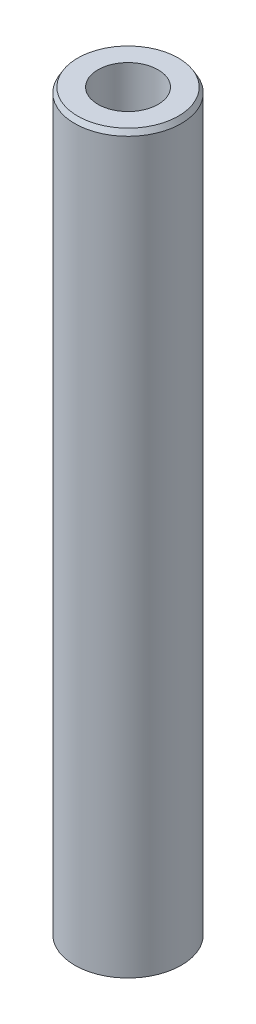
ISO-10303-21;
HEADER;
FILE_DESCRIPTION(('STEP AP214'),'2;1');
FILE_NAME('part.step','',(''),(''),'','','');
FILE_SCHEMA(('AUTOMOTIVE_DESIGN { 1 0 10303 214 1 1 1 1 }'));
ENDSEC;
DATA;
#1=APPLICATION_CONTEXT('core data for automotive mechanical design processes');
#2=APPLICATION_PROTOCOL_DEFINITION('international standard','automotive_design',2000,#1);
#3=PRODUCT_CONTEXT('',#1,'mechanical');
#4=PRODUCT('Part','Part','',(#3));
#5=PRODUCT_RELATED_PRODUCT_CATEGORY('part','',(#4));
#6=PRODUCT_DEFINITION_FORMATION('','',#4);
#7=PRODUCT_DEFINITION_CONTEXT('part definition',#1,'design');
#8=PRODUCT_DEFINITION('design','',#6,#7);
#9=PRODUCT_DEFINITION_SHAPE('','',#8);
#10=(LENGTH_UNIT() NAMED_UNIT(*) SI_UNIT(.MILLI.,.METRE.));
#11=(NAMED_UNIT(*) PLANE_ANGLE_UNIT() SI_UNIT($,.RADIAN.));
#12=(NAMED_UNIT(*) SI_UNIT($,.STERADIAN.) SOLID_ANGLE_UNIT());
#13=UNCERTAINTY_MEASURE_WITH_UNIT(LENGTH_MEASURE(1.E-05),#10,'distance_accuracy_value','');
#14=(GEOMETRIC_REPRESENTATION_CONTEXT(3) GLOBAL_UNCERTAINTY_ASSIGNED_CONTEXT((#13)) GLOBAL_UNIT_ASSIGNED_CONTEXT((#10,
#11,#12)) REPRESENTATION_CONTEXT('',''));
#15=CARTESIAN_POINT('',(0.,0.,0.));
#16=DIRECTION('',(0.,0.,1.));
#17=DIRECTION('',(1.,0.,0.));
#18=AXIS2_PLACEMENT_3D('',#15,#16,#17);
#19=CARTESIAN_POINT('',(0.,346.040194897488,0.));
#20=DIRECTION('',(0.,-1.,0.));
#21=DIRECTION('',(0.,0.,-1.));
#22=AXIS2_PLACEMENT_3D('',#19,#20,#21);
#23=CYLINDRICAL_SURFACE('',#22,25.);
#24=CARTESIAN_POINT('',(0.,343.684730383366,0.));
#25=DIRECTION('',(0.,1.,0.));
#26=DIRECTION('',(0.,0.,1.));
#27=AXIS2_PLACEMENT_3D('',#24,#25,#26);
#28=CIRCLE('',#27,25.);
#29=CARTESIAN_POINT('',(0.,343.684730383366,-25.));
#30=VERTEX_POINT('',#29);
#31=EDGE_CURVE('E50',#30,#30,#28,.F.);
#32=CARTESIAN_POINT('',(0.,1.35992807129515,0.));
#33=DIRECTION('',(0.,1.,0.));
#34=DIRECTION('',(0.,0.,1.));
#35=AXIS2_PLACEMENT_3D('',#32,#33,#34);
#36=CIRCLE('',#35,25.);
#37=CARTESIAN_POINT('',(0.,1.35992807129515,-25.));
#38=VERTEX_POINT('',#37);
#39=EDGE_CURVE('E51',#38,#38,#36,.T.);
#40=CARTESIAN_POINT('',(0.,343.684730383366,-25.));
#41=CARTESIAN_POINT('',(0.,340.118847025949,-25.));
#42=CARTESIAN_POINT('',(0.,336.552963668531,-25.));
#43=CARTESIAN_POINT('',(0.,329.421196953696,-25.));
#44=CARTESIAN_POINT('',(0.,325.855313596279,-25.));
#45=CARTESIAN_POINT('',(0.,318.723546881444,-25.));
#46=CARTESIAN_POINT('',(0.,315.157663524027,-25.));
#47=CARTESIAN_POINT('',(0.,308.025896809192,-25.));
#48=CARTESIAN_POINT('',(0.,304.460013451775,-25.));
#49=CARTESIAN_POINT('',(0.,297.32824673694,-25.));
#50=CARTESIAN_POINT('',(0.,293.762363379522,-25.));
#51=CARTESIAN_POINT('',(0.,286.630596664688,-25.));
#52=CARTESIAN_POINT('',(0.,283.06471330727,-25.));
#53=CARTESIAN_POINT('',(0.,275.932946592435,-25.));
#54=CARTESIAN_POINT('',(0.,272.367063235018,-25.));
#55=CARTESIAN_POINT('',(0.,265.235296520183,-25.));
#56=CARTESIAN_POINT('',(0.,261.669413162766,-25.));
#57=CARTESIAN_POINT('',(0.,254.537646447931,-25.));
#58=CARTESIAN_POINT('',(0.,250.971763090513,-25.));
#59=CARTESIAN_POINT('',(0.,243.839996375679,-25.));
#60=CARTESIAN_POINT('',(0.,240.274113018261,-25.));
#61=CARTESIAN_POINT('',(0.,233.142346303426,-25.));
#62=CARTESIAN_POINT('',(0.,229.576462946009,-25.));
#63=CARTESIAN_POINT('',(0.,222.444696231174,-25.));
#64=CARTESIAN_POINT('',(0.,218.878812873757,-25.));
#65=CARTESIAN_POINT('',(0.,211.747046158922,-25.));
#66=CARTESIAN_POINT('',(0.,208.181162801505,-25.));
#67=CARTESIAN_POINT('',(0.,201.04939608667,-25.));
#68=CARTESIAN_POINT('',(0.,197.483512729252,-25.));
#69=CARTESIAN_POINT('',(0.,190.351746014418,-25.));
#70=CARTESIAN_POINT('',(0.,186.785862657,-25.));
#71=CARTESIAN_POINT('',(0.,179.654095942165,-25.));
#72=CARTESIAN_POINT('',(0.,176.088212584748,-25.));
#73=CARTESIAN_POINT('',(0.,168.956445869913,-25.));
#74=CARTESIAN_POINT('',(0.,165.390562512496,-25.));
#75=CARTESIAN_POINT('',(0.,158.258795797661,-25.));
#76=CARTESIAN_POINT('',(0.,154.692912440244,-25.));
#77=CARTESIAN_POINT('',(0.,147.561145725409,-25.));
#78=CARTESIAN_POINT('',(0.,143.995262367991,-25.));
#79=CARTESIAN_POINT('',(0.,136.863495653156,-25.));
#80=CARTESIAN_POINT('',(0.,133.297612295739,-25.));
#81=CARTESIAN_POINT('',(0.,126.165845580904,-25.));
#82=CARTESIAN_POINT('',(0.,122.599962223487,-25.));
#83=CARTESIAN_POINT('',(0.,115.468195508652,-25.));
#84=CARTESIAN_POINT('',(0.,111.902312151235,-25.));
#85=CARTESIAN_POINT('',(0.,104.7705454364,-25.));
#86=CARTESIAN_POINT('',(0.,101.204662078982,-25.));
#87=CARTESIAN_POINT('',(0.,94.0728953641477,-25.));
#88=CARTESIAN_POINT('',(0.,90.5070120067303,-25.));
#89=CARTESIAN_POINT('',(0.,83.3752452918955,-25.));
#90=CARTESIAN_POINT('',(0.,79.809361934478,-25.));
#91=CARTESIAN_POINT('',(0.,72.6775952196432,-25.));
#92=CARTESIAN_POINT('',(0.,69.1117118622258,-25.));
#93=CARTESIAN_POINT('',(0.,61.979945147391,-25.));
#94=CARTESIAN_POINT('',(0.,58.4140617899736,-25.));
#95=CARTESIAN_POINT('',(0.,51.2822950751388,-25.));
#96=CARTESIAN_POINT('',(0.,47.7164117177214,-25.));
#97=CARTESIAN_POINT('',(0.,40.5846450028866,-25.));
#98=CARTESIAN_POINT('',(0.,37.0187616454692,-25.));
#99=CARTESIAN_POINT('',(0.,29.8869949306344,-25.));
#100=CARTESIAN_POINT('',(0.,26.321111573217,-25.));
#101=CARTESIAN_POINT('',(0.,19.1893448583822,-25.));
#102=CARTESIAN_POINT('',(0.,15.6234615009648,-25.));
#103=CARTESIAN_POINT('',(0.,8.49169478612995,-25.));
#104=CARTESIAN_POINT('',(0.,4.92581142871255,-25.));
#105=CARTESIAN_POINT('',(0.,1.35992807129515,-25.));
#106=B_SPLINE_CURVE_WITH_KNOTS('',3,(#40,#41,#42,#43,#44,#45,#46,#47,#48,#49,#50,#51,#52,#53,
#54,#55,#56,#57,#58,#59,#60,#61,#62,#63,#64,#65,#66,#67,#68,#69,#70,#71,#72,#73,#74,#75,#76,#77,
#78,#79,#80,#81,#82,#83,#84,#85,#86,#87,#88,#89,#90,#91,#92,#93,#94,#95,#96,#97,#98,#99,#100,
#101,#102,#103,#104,#105),.UNSPECIFIED.,.F.,.F.,(4,2,2,2,2,2,2,2,2,2,2,2,2,2,2,2,2,2,2,2,2,2,2,
2,2,2,2,2,2,2,2,2,4),(0.,10.6976500722523,21.3953001445045,32.0929502167567,42.7906002890089,
53.4882503612611,64.1859004335133,74.8835505057655,85.5812005780178,96.27885065027,
106.976500722522,117.674150794774,128.371800867027,139.069450939279,149.767101011531,
160.464751083783,171.162401156035,181.860051228288,192.55770130054,203.255351372792,
213.953001445044,224.650651517297,235.348301589549,246.045951661801,256.743601734053,
267.441251806305,278.138901878558,288.83655195081,299.534202023062,310.231852095314,
320.929502167567,331.627152239819,342.324802312071),.UNSPECIFIED.);
#107=EDGE_CURVE('BSEAM39',#30,#38,#106,.T.);
#108=ORIENTED_EDGE('',*,*,#31,.T.);
#109=ORIENTED_EDGE('',*,*,#39,.T.);
#110=ORIENTED_EDGE('',*,*,#107,.T.);
#111=ORIENTED_EDGE('',*,*,#107,.F.);
#112=EDGE_LOOP('',(#108,#110,#109,#111));
#113=FACE_BOUND('',#112,.T.);
#114=ADVANCED_FACE('F39',(#113),#23,.T.);
#115=CARTESIAN_POINT('',(0.,346.040194897488,0.));
#116=DIRECTION('',(0.,1.,0.));
#117=DIRECTION('',(0.,0.,1.));
#118=AXIS2_PLACEMENT_3D('',#115,#116,#117);
#119=PLANE('',#118);
#120=CARTESIAN_POINT('',(0.,346.040194897488,0.));
#121=DIRECTION('',(0.,1.,0.));
#122=DIRECTION('',(0.,0.,1.));
#123=AXIS2_PLACEMENT_3D('',#120,#121,#122);
#124=CIRCLE('',#123,23.6400719287051);
#125=CARTESIAN_POINT('',(0.,346.040194897488,-23.6400719287051));
#126=VERTEX_POINT('',#125);
#127=EDGE_CURVE('E54',#126,#126,#124,.T.);
#128=ORIENTED_EDGE('',*,*,#127,.T.);
#129=EDGE_LOOP('',(#128));
#130=FACE_BOUND('',#129,.T.);
#131=CARTESIAN_POINT('',(0.,346.040194897488,0.));
#132=DIRECTION('',(0.,1.,0.));
#133=DIRECTION('',(0.,0.,1.));
#134=AXIS2_PLACEMENT_3D('',#131,#132,#133);
#135=CIRCLE('',#134,14.1102254185746);
#136=CARTESIAN_POINT('',(0.,346.040194897488,-14.1102254185746));
#137=VERTEX_POINT('',#136);
#138=EDGE_CURVE('E58',#137,#137,#135,.T.);
#139=ORIENTED_EDGE('',*,*,#138,.F.);
#140=EDGE_LOOP('',(#139));
#141=FACE_BOUND('',#140,.T.);
#142=ADVANCED_FACE('F69',(#130,#141),#119,.T.);
#143=CARTESIAN_POINT('',(0.,0.,0.));
#144=DIRECTION('',(0.,1.,0.));
#145=DIRECTION('',(0.,0.,1.));
#146=AXIS2_PLACEMENT_3D('',#143,#144,#145);
#147=PLANE('',#146);
#148=CARTESIAN_POINT('',(0.,0.,0.));
#149=DIRECTION('',(0.,1.,0.));
#150=DIRECTION('',(0.,0.,1.));
#151=AXIS2_PLACEMENT_3D('',#148,#149,#150);
#152=CIRCLE('',#151,22.6445354858776);
#153=CARTESIAN_POINT('',(0.,0.,22.6445354858776));
#154=VERTEX_POINT('',#153);
#155=EDGE_CURVE('E10',#154,#154,#152,.F.);
#156=ORIENTED_EDGE('',*,*,#155,.T.);
#157=EDGE_LOOP('',(#156));
#158=FACE_BOUND('',#157,.T.);
#159=CARTESIAN_POINT('',(0.,0.,0.));
#160=DIRECTION('',(0.,1.,0.));
#161=DIRECTION('',(0.,0.,1.));
#162=AXIS2_PLACEMENT_3D('',#159,#160,#161);
#163=CIRCLE('',#162,14.1102254185746);
#164=CARTESIAN_POINT('',(0.,0.,-14.1102254185746));
#165=VERTEX_POINT('',#164);
#166=EDGE_CURVE('E63',#165,#165,#163,.T.);
#167=ORIENTED_EDGE('',*,*,#166,.T.);
#168=EDGE_LOOP('',(#167));
#169=FACE_BOUND('',#168,.T.);
#170=ADVANCED_FACE('F75',(#158,#169),#147,.F.);
#171=CARTESIAN_POINT('',(0.,346.040194897488,0.));
#172=DIRECTION('',(0.,-1.,0.));
#173=DIRECTION('',(0.,0.,-1.));
#174=AXIS2_PLACEMENT_3D('',#171,#172,#173);
#175=CYLINDRICAL_SURFACE('',#174,14.1102254185746);
#176=CARTESIAN_POINT('',(0.,346.040194897488,-14.1102254185746));
#177=CARTESIAN_POINT('',(0.,342.435609533972,-14.1102254185746));
#178=CARTESIAN_POINT('',(0.,338.831024170457,-14.1102254185746));
#179=CARTESIAN_POINT('',(0.,331.621853443426,-14.1102254185746));
#180=CARTESIAN_POINT('',(0.,328.01726807991,-14.1102254185746));
#181=CARTESIAN_POINT('',(0.,320.808097352879,-14.1102254185746));
#182=CARTESIAN_POINT('',(0.,317.203511989364,-14.1102254185746));
#183=CARTESIAN_POINT('',(0.,309.994341262333,-14.1102254185746));
#184=CARTESIAN_POINT('',(0.,306.389755898817,-14.1102254185746));
#185=CARTESIAN_POINT('',(0.,299.180585171786,-14.1102254185746));
#186=CARTESIAN_POINT('',(0.,295.575999808271,-14.1102254185746));
#187=CARTESIAN_POINT('',(0.,288.36682908124,-14.1102254185746));
#188=CARTESIAN_POINT('',(0.,284.762243717724,-14.1102254185746));
#189=CARTESIAN_POINT('',(0.,277.553072990693,-14.1102254185746));
#190=CARTESIAN_POINT('',(0.,273.948487627178,-14.1102254185746));
#191=CARTESIAN_POINT('',(0.,266.739316900147,-14.1102254185746));
#192=CARTESIAN_POINT('',(0.,263.134731536631,-14.1102254185746));
#193=CARTESIAN_POINT('',(0.,255.9255608096,-14.1102254185746));
#194=CARTESIAN_POINT('',(0.,252.320975446085,-14.1102254185746));
#195=CARTESIAN_POINT('',(0.,245.111804719054,-14.1102254185746));
#196=CARTESIAN_POINT('',(0.,241.507219355538,-14.1102254185746));
#197=CARTESIAN_POINT('',(0.,234.298048628507,-14.1102254185746));
#198=CARTESIAN_POINT('',(0.,230.693463264992,-14.1102254185746));
#199=CARTESIAN_POINT('',(0.,223.484292537961,-14.1102254185746));
#200=CARTESIAN_POINT('',(0.,219.879707174445,-14.1102254185746));
#201=CARTESIAN_POINT('',(0.,212.670536447415,-14.1102254185746));
#202=CARTESIAN_POINT('',(0.,209.065951083899,-14.1102254185746));
#203=CARTESIAN_POINT('',(0.,201.856780356868,-14.1102254185746));
#204=CARTESIAN_POINT('',(0.,198.252194993353,-14.1102254185746));
#205=CARTESIAN_POINT('',(0.,191.043024266322,-14.1102254185746));
#206=CARTESIAN_POINT('',(0.,187.438438902806,-14.1102254185746));
#207=CARTESIAN_POINT('',(0.,180.229268175775,-14.1102254185746));
#208=CARTESIAN_POINT('',(0.,176.624682812259,-14.1102254185746));
#209=CARTESIAN_POINT('',(0.,169.415512085228,-14.1102254185746));
#210=CARTESIAN_POINT('',(0.,165.810926721713,-14.1102254185746));
#211=CARTESIAN_POINT('',(0.,158.601755994682,-14.1102254185746));
#212=CARTESIAN_POINT('',(0.,154.997170631167,-14.1102254185746));
#213=CARTESIAN_POINT('',(0.,147.787999904135,-14.1102254185746));
#214=CARTESIAN_POINT('',(0.,144.18341454062,-14.1102254185746));
#215=CARTESIAN_POINT('',(0.,136.974243813589,-14.1102254185746));
#216=CARTESIAN_POINT('',(0.,133.369658450073,-14.1102254185746));
#217=CARTESIAN_POINT('',(0.,126.160487723043,-14.1102254185746));
#218=CARTESIAN_POINT('',(0.,122.555902359527,-14.1102254185746));
#219=CARTESIAN_POINT('',(0.,115.346731632496,-14.1102254185746));
#220=CARTESIAN_POINT('',(0.,111.742146268981,-14.1102254185746));
#221=CARTESIAN_POINT('',(0.,104.532975541949,-14.1102254185746));
#222=CARTESIAN_POINT('',(0.,100.928390178434,-14.1102254185746));
#223=CARTESIAN_POINT('',(0.,93.719219451403,-14.1102254185746));
#224=CARTESIAN_POINT('',(0.,90.1146340878875,-14.1102254185746));
#225=CARTESIAN_POINT('',(0.,82.9054633608565,-14.1102254185746));
#226=CARTESIAN_POINT('',(0.,79.300877997341,-14.1102254185746));
#227=CARTESIAN_POINT('',(0.,72.09170727031,-14.1102254185746));
#228=CARTESIAN_POINT('',(0.,68.4871219067945,-14.1102254185746));
#229=CARTESIAN_POINT('',(0.,61.2779511797635,-14.1102254185746));
#230=CARTESIAN_POINT('',(0.,57.673365816248,-14.1102254185746));
#231=CARTESIAN_POINT('',(0.,50.464195089217,-14.1102254185746));
#232=CARTESIAN_POINT('',(0.,46.8596097257015,-14.1102254185746));
#233=CARTESIAN_POINT('',(0.,39.6504389986705,-14.1102254185746));
#234=CARTESIAN_POINT('',(0.,36.045853635155,-14.1102254185746));
#235=CARTESIAN_POINT('',(0.,28.836682908124,-14.1102254185746));
#236=CARTESIAN_POINT('',(0.,25.2320975446085,-14.1102254185746));
#237=CARTESIAN_POINT('',(0.,18.0229268175775,-14.1102254185746));
#238=CARTESIAN_POINT('',(0.,14.418341454062,-14.1102254185746));
#239=CARTESIAN_POINT('',(0.,7.20917072703102,-14.1102254185746));
#240=CARTESIAN_POINT('',(0.,3.60458536351551,-14.1102254185746));
#241=CARTESIAN_POINT('',(0.,0.,-14.1102254185746));
#242=B_SPLINE_CURVE_WITH_KNOTS('',3,(#176,#177,#178,#179,#180,#181,#182,#183,#184,#185,#186,
#187,#188,#189,#190,#191,#192,#193,#194,#195,#196,#197,#198,#199,#200,#201,#202,#203,#204,#205,
#206,#207,#208,#209,#210,#211,#212,#213,#214,#215,#216,#217,#218,#219,#220,#221,#222,#223,#224,
#225,#226,#227,#228,#229,#230,#231,#232,#233,#234,#235,#236,#237,#238,#239,#240,#241),
.UNSPECIFIED.,.F.,.F.,(4,2,2,2,2,2,2,2,2,2,2,2,2,2,2,2,2,2,2,2,2,2,2,2,2,2,2,2,2,2,2,2,4),(0.,
10.8137560905465,21.627512181093,32.4412682716395,43.255024362186,54.0687804527324,
64.882536543279,75.6962926338255,86.510048724372,97.3238048149184,108.137560905465,
118.951316996011,129.765073086558,140.578829177104,151.392585267651,162.206341358197,
173.020097448744,183.83385353929,194.647609629837,205.461365720383,216.27512181093,
227.088877901476,237.902633992023,248.716390082569,259.530146173116,270.343902263662,
281.157658354209,291.971414444755,302.785170535302,313.598926625848,324.412682716395,
335.226438806941,346.040194897488),.UNSPECIFIED.);
#243=EDGE_CURVE('BSEAM70',#137,#165,#242,.T.);
#244=ORIENTED_EDGE('',*,*,#138,.T.);
#245=ORIENTED_EDGE('',*,*,#166,.F.);
#246=ORIENTED_EDGE('',*,*,#243,.T.);
#247=ORIENTED_EDGE('',*,*,#243,.F.);
#248=EDGE_LOOP('',(#244,#246,#245,#247));
#249=FACE_BOUND('',#248,.T.);
#250=ADVANCED_FACE('F70',(#249),#175,.F.);
#251=CARTESIAN_POINT('',(0.,346.040194897488,0.));
#252=DIRECTION('',(0.,-1.,0.));
#253=DIRECTION('',(0.,0.,-1.));
#254=AXIS2_PLACEMENT_3D('',#251,#252,#253);
#255=CONICAL_SURFACE('',#254,23.6400719287051,0.523598775598288);
#256=CARTESIAN_POINT('',(0.,343.684730383366,-25.));
#257=CARTESIAN_POINT('',(0.,343.709266472055,-24.9858340825907));
#258=CARTESIAN_POINT('',(0.,343.733802560744,-24.9716681651814));
#259=CARTESIAN_POINT('',(0.,343.782874738121,-24.9433363303627));
#260=CARTESIAN_POINT('',(0.,343.80741082681,-24.9291704129534));
#261=CARTESIAN_POINT('',(0.,343.856483004187,-24.9008385781348));
#262=CARTESIAN_POINT('',(0.,343.881019092876,-24.8866726607254));
#263=CARTESIAN_POINT('',(0.,343.930091270254,-24.8583408259068));
#264=CARTESIAN_POINT('',(0.,343.954627358943,-24.8441749084975));
#265=CARTESIAN_POINT('',(0.,344.00369953632,-24.8158430736788));
#266=CARTESIAN_POINT('',(0.,344.028235625009,-24.8016771562695));
#267=CARTESIAN_POINT('',(0.,344.077307802386,-24.7733453214509));
#268=CARTESIAN_POINT('',(0.,344.101843891075,-24.7591794040416));
#269=CARTESIAN_POINT('',(0.,344.150916068453,-24.7308475692229));
#270=CARTESIAN_POINT('',(0.,344.175452157141,-24.7166816518136));
#271=CARTESIAN_POINT('',(0.,344.224524334519,-24.6883498169949));
#272=CARTESIAN_POINT('',(0.,344.249060423208,-24.6741838995856));
#273=CARTESIAN_POINT('',(0.,344.298132600585,-24.645852064767));
#274=CARTESIAN_POINT('',(0.,344.322668689274,-24.6316861473577));
#275=CARTESIAN_POINT('',(0.,344.371740866652,-24.603354312539));
#276=CARTESIAN_POINT('',(0.,344.39627695534,-24.5891883951297));
#277=CARTESIAN_POINT('',(0.,344.445349132718,-24.560856560311));
#278=CARTESIAN_POINT('',(0.,344.469885221407,-24.5466906429017));
#279=CARTESIAN_POINT('',(0.,344.518957398784,-24.5183588080831));
#280=CARTESIAN_POINT('',(0.,344.543493487473,-24.5041928906738));
#281=CARTESIAN_POINT('',(0.,344.592565664851,-24.4758610558551));
#282=CARTESIAN_POINT('',(0.,344.617101753539,-24.4616951384458));
#283=CARTESIAN_POINT('',(0.,344.666173930917,-24.4333633036271));
#284=CARTESIAN_POINT('',(0.,344.690710019606,-24.4191973862178));
#285=CARTESIAN_POINT('',(0.,344.739782196983,-24.3908655513992));
#286=CARTESIAN_POINT('',(0.,344.764318285672,-24.3766996339899));
#287=CARTESIAN_POINT('',(0.,344.813390463049,-24.3483677991712));
#288=CARTESIAN_POINT('',(0.,344.837926551738,-24.3342018817619));
#289=CARTESIAN_POINT('',(0.,344.886998729116,-24.3058700469433));
#290=CARTESIAN_POINT('',(0.,344.911534817805,-24.2917041295339));
#291=CARTESIAN_POINT('',(0.,344.960606995182,-24.2633722947153));
#292=CARTESIAN_POINT('',(0.,344.985143083871,-24.249206377306));
#293=CARTESIAN_POINT('',(0.,345.034215261248,-24.2208745424873));
#294=CARTESIAN_POINT('',(0.,345.058751349937,-24.206708625078));
#295=CARTESIAN_POINT('',(0.,345.107823527315,-24.1783767902594));
#296=CARTESIAN_POINT('',(0.,345.132359616003,-24.16421087285));
#297=CARTESIAN_POINT('',(0.,345.181431793381,-24.1358790380314));
#298=CARTESIAN_POINT('',(0.,345.20596788207,-24.1217131206221));
#299=CARTESIAN_POINT('',(0.,345.255040059447,-24.0933812858034));
#300=CARTESIAN_POINT('',(0.,345.279576148136,-24.0792153683941));
#301=CARTESIAN_POINT('',(0.,345.328648325514,-24.0508835335755));
#302=CARTESIAN_POINT('',(0.,345.353184414202,-24.0367176161661));
#303=CARTESIAN_POINT('',(0.,345.40225659158,-24.0083857813475));
#304=CARTESIAN_POINT('',(0.,345.426792680269,-23.9942198639382));
#305=CARTESIAN_POINT('',(0.,345.475864857646,-23.9658880291195));
#306=CARTESIAN_POINT('',(0.,345.500400946335,-23.9517221117102));
#307=CARTESIAN_POINT('',(0.,345.549473123713,-23.9233902768916));
#308=CARTESIAN_POINT('',(0.,345.574009212401,-23.9092243594823));
#309=CARTESIAN_POINT('',(0.,345.623081389779,-23.8808925246636));
#310=CARTESIAN_POINT('',(0.,345.647617478468,-23.8667266072543));
#311=CARTESIAN_POINT('',(0.,345.696689655845,-23.8383947724356));
#312=CARTESIAN_POINT('',(0.,345.721225744534,-23.8242288550263));
#313=CARTESIAN_POINT('',(0.,345.770297921911,-23.7958970202077));
#314=CARTESIAN_POINT('',(0.,345.7948340106,-23.7817311027984));
#315=CARTESIAN_POINT('',(0.,345.843906187978,-23.7533992679797));
#316=CARTESIAN_POINT('',(0.,345.868442276667,-23.7392333505704));
#317=CARTESIAN_POINT('',(0.,345.917514454044,-23.7109015157518));
#318=CARTESIAN_POINT('',(0.,345.942050542733,-23.6967355983424));
#319=CARTESIAN_POINT('',(0.,345.99112272011,-23.6684037635238));
#320=CARTESIAN_POINT('',(0.,346.015658808799,-23.6542378461144));
#321=CARTESIAN_POINT('',(0.,346.040194897488,-23.6400719287051));
#322=B_SPLINE_CURVE_WITH_KNOTS('',3,(#256,#257,#258,#259,#260,#261,#262,#263,#264,#265,#266,
#267,#268,#269,#270,#271,#272,#273,#274,#275,#276,#277,#278,#279,#280,#281,#282,#283,#284,#285,
#286,#287,#288,#289,#290,#291,#292,#293,#294,#295,#296,#297,#298,#299,#300,#301,#302,#303,#304,
#305,#306,#307,#308,#309,#310,#311,#312,#313,#314,#315,#316,#317,#318,#319,#320,#321),
.UNSPECIFIED.,.F.,.F.,(4,2,2,2,2,2,2,2,2,2,2,2,2,2,2,2,2,2,2,2,2,2,2,2,2,2,2,2,2,2,2,2,4),(0.,
0.0849955044559082,0.169991008911865,0.254986513367771,0.339982017823727,0.424977522279634,
0.50997302673559,0.594968531191499,0.679964035647453,0.764959540103361,0.849955044559316,
0.934950549015224,1.01994605347118,1.10494155792709,1.18993706238304,1.27493256683895,
1.35992807129491,1.44492357575081,1.52991908020677,1.61491458466268,1.69991008911863,
1.78490559357454,1.8699010980305,1.9548966024864,2.03989210694236,2.12488761139827,
2.20988311585422,2.29487862031013,2.37987412476608,2.46486962922199,2.54986513367795,
2.63486063813386,2.71985614258981),.UNSPECIFIED.);
#323=EDGE_CURVE('BSEAM81',#30,#126,#322,.T.);
#324=ORIENTED_EDGE('',*,*,#31,.F.);
#325=ORIENTED_EDGE('',*,*,#127,.F.);
#326=ORIENTED_EDGE('',*,*,#323,.T.);
#327=ORIENTED_EDGE('',*,*,#323,.F.);
#328=EDGE_LOOP('',(#324,#326,#325,#327));
#329=FACE_BOUND('',#328,.T.);
#330=ADVANCED_FACE('F81',(#329),#255,.T.);
#331=CARTESIAN_POINT('',(0.,1.35992807129515,0.));
#332=DIRECTION('',(0.,1.,0.));
#333=DIRECTION('',(0.,0.,1.));
#334=AXIS2_PLACEMENT_3D('',#331,#332,#333);
#335=CONICAL_SURFACE('',#334,25.,1.0471975511966);
#336=ORIENTED_EDGE('',*,*,#155,.F.);
#337=EDGE_LOOP('',(#336));
#338=FACE_BOUND('',#337,.T.);
#339=ORIENTED_EDGE('',*,*,#39,.F.);
#340=EDGE_LOOP('',(#339));
#341=FACE_BOUND('',#340,.T.);
#342=ADVANCED_FACE('F45',(#338,#341),#335,.T.);
#343=CLOSED_SHELL('',(#114,#142,#170,#250,#330,#342));
#344=MANIFOLD_SOLID_BREP('B2',#343);
#345=ADVANCED_BREP_SHAPE_REPRESENTATION('',(#18,#344),#14);
#346=SHAPE_DEFINITION_REPRESENTATION(#9,#345);
ENDSEC;
END-ISO-10303-21;
